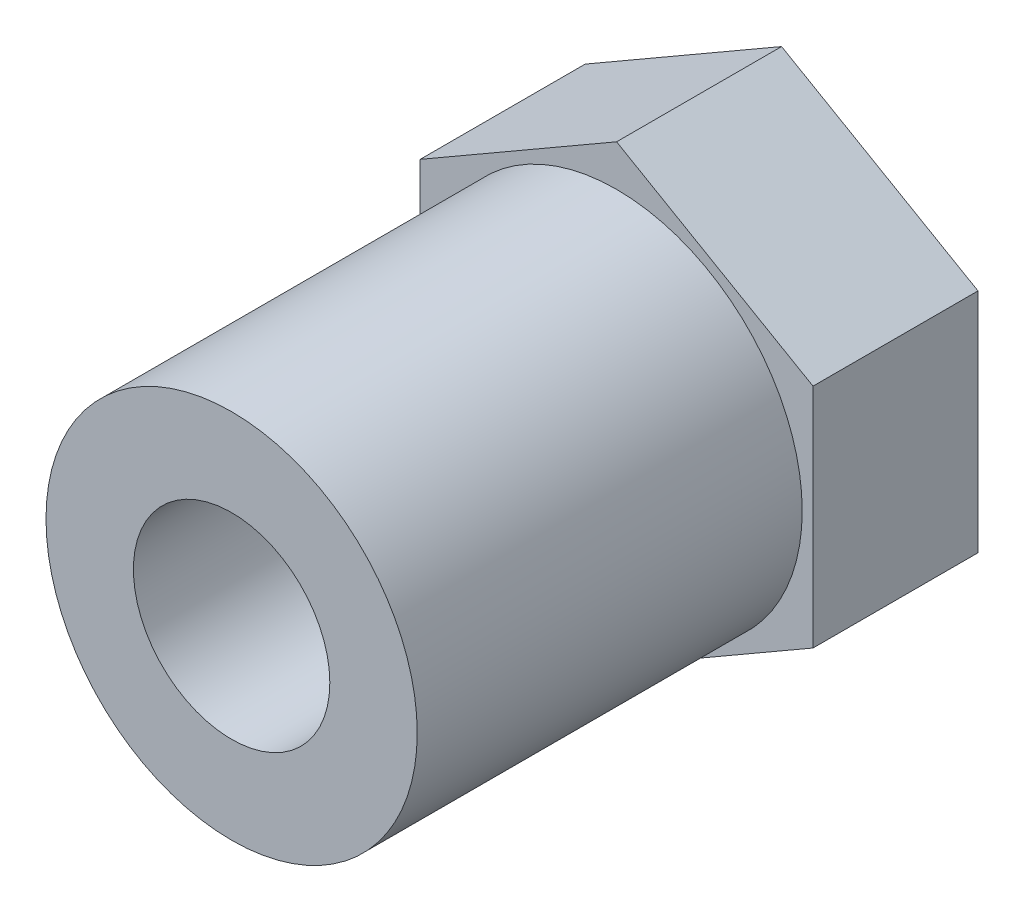
ISO-10303-21;
HEADER;
FILE_DESCRIPTION(('STEP AP214'),'2;1');
FILE_NAME('part.step','',(''),(''),'','','');
FILE_SCHEMA(('AUTOMOTIVE_DESIGN { 1 0 10303 214 1 1 1 1 }'));
ENDSEC;
DATA;
#1=APPLICATION_CONTEXT('core data for automotive mechanical design processes');
#2=APPLICATION_PROTOCOL_DEFINITION('international standard','automotive_design',2000,#1);
#3=PRODUCT_CONTEXT('',#1,'mechanical');
#4=PRODUCT('Part','Part','',(#3));
#5=PRODUCT_RELATED_PRODUCT_CATEGORY('part','',(#4));
#6=PRODUCT_DEFINITION_FORMATION('','',#4);
#7=PRODUCT_DEFINITION_CONTEXT('part definition',#1,'design');
#8=PRODUCT_DEFINITION('design','',#6,#7);
#9=PRODUCT_DEFINITION_SHAPE('','',#8);
#10=(LENGTH_UNIT() NAMED_UNIT(*) SI_UNIT(.MILLI.,.METRE.));
#11=(NAMED_UNIT(*) PLANE_ANGLE_UNIT() SI_UNIT($,.RADIAN.));
#12=(NAMED_UNIT(*) SI_UNIT($,.STERADIAN.) SOLID_ANGLE_UNIT());
#13=UNCERTAINTY_MEASURE_WITH_UNIT(LENGTH_MEASURE(1.E-05),#10,'distance_accuracy_value','');
#14=(GEOMETRIC_REPRESENTATION_CONTEXT(3) GLOBAL_UNCERTAINTY_ASSIGNED_CONTEXT((#13)) GLOBAL_UNIT_ASSIGNED_CONTEXT((#10,
#11,#12)) REPRESENTATION_CONTEXT('',''));
#15=CARTESIAN_POINT('',(0.,0.,0.));
#16=DIRECTION('',(0.,0.,1.));
#17=DIRECTION('',(1.,0.,0.));
#18=AXIS2_PLACEMENT_3D('',#15,#16,#17);
#19=CARTESIAN_POINT('',(0.,0.,4.2));
#20=DIRECTION('',(0.,0.,1.));
#21=DIRECTION('',(1.,0.,0.));
#22=AXIS2_PLACEMENT_3D('',#19,#20,#21);
#23=PLANE('',#22);
#24=CARTESIAN_POINT('',(0.,0.,4.2));
#25=DIRECTION('',(0.,0.,1.));
#26=DIRECTION('',(1.,0.,0.));
#27=AXIS2_PLACEMENT_3D('',#24,#25,#26);
#28=CIRCLE('',#27,4.725);
#29=CARTESIAN_POINT('',(4.725,0.,4.2));
#30=VERTEX_POINT('',#29);
#31=EDGE_CURVE('E11',#30,#30,#28,.T.);
#32=ORIENTED_EDGE('',*,*,#31,.F.);
#33=EDGE_LOOP('',(#32));
#34=FACE_BOUND('',#33,.T.);
#35=DIRECTION('',(0.,1.,0.));
#36=VECTOR('',#35,1.);
#37=CARTESIAN_POINT('',(5.,-2.88675134594813,4.2));
#38=LINE('',#37,#36);
#39=CARTESIAN_POINT('',(5.,-2.88675134594813,4.2));
#40=VERTEX_POINT('',#39);
#41=CARTESIAN_POINT('',(5.,2.88675134594813,4.2));
#42=VERTEX_POINT('',#41);
#43=EDGE_CURVE('E130',#40,#42,#38,.T.);
#44=ORIENTED_EDGE('',*,*,#43,.T.);
#45=DIRECTION('',(-0.866025403784439,0.5,0.));
#46=VECTOR('',#45,1.);
#47=CARTESIAN_POINT('',(5.,2.88675134594813,4.2));
#48=LINE('',#47,#46);
#49=CARTESIAN_POINT('',(0.,5.77350269189626,4.2));
#50=VERTEX_POINT('',#49);
#51=EDGE_CURVE('E89',#42,#50,#48,.T.);
#52=ORIENTED_EDGE('',*,*,#51,.T.);
#53=DIRECTION('',(-0.866025403784438,-0.500000000000001,0.));
#54=VECTOR('',#53,1.);
#55=CARTESIAN_POINT('',(0.,5.77350269189626,4.2));
#56=LINE('',#55,#54);
#57=CARTESIAN_POINT('',(-5.,2.88675134594813,4.2));
#58=VERTEX_POINT('',#57);
#59=EDGE_CURVE('E101',#50,#58,#56,.T.);
#60=ORIENTED_EDGE('',*,*,#59,.T.);
#61=DIRECTION('',(0.,-1.,0.));
#62=VECTOR('',#61,1.);
#63=CARTESIAN_POINT('',(-5.,2.88675134594813,4.2));
#64=LINE('',#63,#62);
#65=CARTESIAN_POINT('',(-5.,-2.88675134594813,4.2));
#66=VERTEX_POINT('',#65);
#67=EDGE_CURVE('E96',#58,#66,#64,.T.);
#68=ORIENTED_EDGE('',*,*,#67,.T.);
#69=DIRECTION('',(0.866025403784439,-0.5,0.));
#70=VECTOR('',#69,1.);
#71=CARTESIAN_POINT('',(-5.,-2.88675134594813,4.2));
#72=LINE('',#71,#70);
#73=CARTESIAN_POINT('',(0.,-5.77350269189626,4.2));
#74=VERTEX_POINT('',#73);
#75=EDGE_CURVE('E99',#66,#74,#72,.T.);
#76=ORIENTED_EDGE('',*,*,#75,.T.);
#77=DIRECTION('',(0.866025403784438,0.5,0.));
#78=VECTOR('',#77,1.);
#79=CARTESIAN_POINT('',(0.,-5.77350269189626,4.2));
#80=LINE('',#79,#78);
#81=EDGE_CURVE('E51',#74,#40,#80,.T.);
#82=ORIENTED_EDGE('',*,*,#81,.T.);
#83=EDGE_LOOP('',(#44,#52,#60,#68,#76,#82));
#84=FACE_BOUND('',#83,.T.);
#85=ADVANCED_FACE('F33',(#34,#84),#23,.T.);
#86=CARTESIAN_POINT('',(0.,0.,0.));
#87=DIRECTION('',(0.,0.,1.));
#88=DIRECTION('',(1.,0.,0.));
#89=AXIS2_PLACEMENT_3D('',#86,#87,#88);
#90=PLANE('',#89);
#91=DIRECTION('',(0.,1.,0.));
#92=VECTOR('',#91,1.);
#93=CARTESIAN_POINT('',(5.,-2.88675134594813,0.));
#94=LINE('',#93,#92);
#95=CARTESIAN_POINT('',(5.,-2.88675134594813,0.));
#96=VERTEX_POINT('',#95);
#97=CARTESIAN_POINT('',(5.,2.88675134594813,0.));
#98=VERTEX_POINT('',#97);
#99=EDGE_CURVE('E119',#96,#98,#94,.T.);
#100=ORIENTED_EDGE('',*,*,#99,.F.);
#101=DIRECTION('',(0.866025403784438,0.5,0.));
#102=VECTOR('',#101,1.);
#103=CARTESIAN_POINT('',(0.,-5.77350269189626,0.));
#104=LINE('',#103,#102);
#105=CARTESIAN_POINT('',(0.,-5.77350269189626,0.));
#106=VERTEX_POINT('',#105);
#107=EDGE_CURVE('E80',#106,#96,#104,.T.);
#108=ORIENTED_EDGE('',*,*,#107,.F.);
#109=DIRECTION('',(0.866025403784439,-0.5,0.));
#110=VECTOR('',#109,1.);
#111=CARTESIAN_POINT('',(-5.,-2.88675134594813,0.));
#112=LINE('',#111,#110);
#113=CARTESIAN_POINT('',(-5.,-2.88675134594813,0.));
#114=VERTEX_POINT('',#113);
#115=EDGE_CURVE('E74',#114,#106,#112,.T.);
#116=ORIENTED_EDGE('',*,*,#115,.F.);
#117=DIRECTION('',(0.,-1.,0.));
#118=VECTOR('',#117,1.);
#119=CARTESIAN_POINT('',(-5.,2.88675134594813,0.));
#120=LINE('',#119,#118);
#121=CARTESIAN_POINT('',(-5.,2.88675134594813,0.));
#122=VERTEX_POINT('',#121);
#123=EDGE_CURVE('E109',#122,#114,#120,.T.);
#124=ORIENTED_EDGE('',*,*,#123,.F.);
#125=DIRECTION('',(-0.866025403784438,-0.500000000000001,0.));
#126=VECTOR('',#125,1.);
#127=CARTESIAN_POINT('',(0.,5.77350269189626,0.));
#128=LINE('',#127,#126);
#129=CARTESIAN_POINT('',(0.,5.77350269189626,0.));
#130=VERTEX_POINT('',#129);
#131=EDGE_CURVE('E125',#130,#122,#128,.T.);
#132=ORIENTED_EDGE('',*,*,#131,.F.);
#133=DIRECTION('',(-0.866025403784439,0.5,0.));
#134=VECTOR('',#133,1.);
#135=CARTESIAN_POINT('',(5.,2.88675134594813,0.));
#136=LINE('',#135,#134);
#137=EDGE_CURVE('E122',#98,#130,#136,.T.);
#138=ORIENTED_EDGE('',*,*,#137,.F.);
#139=EDGE_LOOP('',(#100,#108,#116,#124,#132,#138));
#140=FACE_BOUND('',#139,.T.);
#141=CARTESIAN_POINT('',(0.,0.,0.));
#142=DIRECTION('',(0.,0.,1.));
#143=DIRECTION('',(1.,0.,0.));
#144=AXIS2_PLACEMENT_3D('',#141,#142,#143);
#145=CIRCLE('',#144,2.5);
#146=CARTESIAN_POINT('',(2.5,0.,0.));
#147=VERTEX_POINT('',#146);
#148=EDGE_CURVE('E123',#147,#147,#145,.T.);
#149=ORIENTED_EDGE('',*,*,#148,.T.);
#150=EDGE_LOOP('',(#149));
#151=FACE_BOUND('',#150,.T.);
#152=ADVANCED_FACE('F143',(#140,#151),#90,.F.);
#153=CARTESIAN_POINT('',(5.,-2.88675134594813,4.2));
#154=DIRECTION('',(-1.,0.,0.));
#155=DIRECTION('',(0.,-1.,0.));
#156=AXIS2_PLACEMENT_3D('',#153,#154,#155);
#157=PLANE('',#156);
#158=ORIENTED_EDGE('',*,*,#99,.T.);
#159=DIRECTION('',(0.,0.,-1.));
#160=VECTOR('',#159,1.);
#161=CARTESIAN_POINT('',(5.,2.88675134594813,4.2));
#162=LINE('',#161,#160);
#163=EDGE_CURVE('E37',#42,#98,#162,.T.);
#164=ORIENTED_EDGE('',*,*,#163,.F.);
#165=ORIENTED_EDGE('',*,*,#43,.F.);
#166=DIRECTION('',(0.,0.,-1.));
#167=VECTOR('',#166,1.);
#168=CARTESIAN_POINT('',(5.,-2.88675134594813,4.2));
#169=LINE('',#168,#167);
#170=EDGE_CURVE('E115',#40,#96,#169,.T.);
#171=ORIENTED_EDGE('',*,*,#170,.T.);
#172=EDGE_LOOP('',(#158,#164,#165,#171));
#173=FACE_BOUND('',#172,.T.);
#174=ADVANCED_FACE('F35',(#173),#157,.F.);
#175=CARTESIAN_POINT('',(5.,2.88675134594813,4.2));
#176=DIRECTION('',(-0.5,-0.866025403784439,0.));
#177=DIRECTION('',(0.866025403784439,-0.5,0.));
#178=AXIS2_PLACEMENT_3D('',#175,#176,#177);
#179=PLANE('',#178);
#180=ORIENTED_EDGE('',*,*,#137,.T.);
#181=DIRECTION('',(0.,0.,-1.));
#182=VECTOR('',#181,1.);
#183=CARTESIAN_POINT('',(0.,5.77350269189626,4.2));
#184=LINE('',#183,#182);
#185=EDGE_CURVE('E133',#50,#130,#184,.T.);
#186=ORIENTED_EDGE('',*,*,#185,.F.);
#187=ORIENTED_EDGE('',*,*,#51,.F.);
#188=ORIENTED_EDGE('',*,*,#163,.T.);
#189=EDGE_LOOP('',(#180,#186,#187,#188));
#190=FACE_BOUND('',#189,.T.);
#191=ADVANCED_FACE('F138',(#190),#179,.F.);
#192=CARTESIAN_POINT('',(0.,5.77350269189626,4.2));
#193=DIRECTION('',(0.500000000000001,-0.866025403784438,0.));
#194=DIRECTION('',(0.866025403784438,0.500000000000001,0.));
#195=AXIS2_PLACEMENT_3D('',#192,#193,#194);
#196=PLANE('',#195);
#197=ORIENTED_EDGE('',*,*,#131,.T.);
#198=DIRECTION('',(0.,0.,-1.));
#199=VECTOR('',#198,1.);
#200=CARTESIAN_POINT('',(-5.,2.88675134594813,4.2));
#201=LINE('',#200,#199);
#202=EDGE_CURVE('E110',#58,#122,#201,.T.);
#203=ORIENTED_EDGE('',*,*,#202,.F.);
#204=ORIENTED_EDGE('',*,*,#59,.F.);
#205=ORIENTED_EDGE('',*,*,#185,.T.);
#206=EDGE_LOOP('',(#197,#203,#204,#205));
#207=FACE_BOUND('',#206,.T.);
#208=ADVANCED_FACE('F145',(#207),#196,.F.);
#209=CARTESIAN_POINT('',(-5.,2.88675134594813,4.2));
#210=DIRECTION('',(1.,0.,0.));
#211=DIRECTION('',(0.,1.,0.));
#212=AXIS2_PLACEMENT_3D('',#209,#210,#211);
#213=PLANE('',#212);
#214=ORIENTED_EDGE('',*,*,#123,.T.);
#215=DIRECTION('',(0.,0.,-1.));
#216=VECTOR('',#215,1.);
#217=CARTESIAN_POINT('',(-5.,-2.88675134594813,4.2));
#218=LINE('',#217,#216);
#219=EDGE_CURVE('E106',#66,#114,#218,.T.);
#220=ORIENTED_EDGE('',*,*,#219,.F.);
#221=ORIENTED_EDGE('',*,*,#67,.F.);
#222=ORIENTED_EDGE('',*,*,#202,.T.);
#223=EDGE_LOOP('',(#214,#220,#221,#222));
#224=FACE_BOUND('',#223,.T.);
#225=ADVANCED_FACE('F107',(#224),#213,.F.);
#226=CARTESIAN_POINT('',(-5.,-2.88675134594813,4.2));
#227=DIRECTION('',(0.5,0.866025403784439,0.));
#228=DIRECTION('',(-0.866025403784439,0.5,0.));
#229=AXIS2_PLACEMENT_3D('',#226,#227,#228);
#230=PLANE('',#229);
#231=ORIENTED_EDGE('',*,*,#115,.T.);
#232=DIRECTION('',(0.,0.,-1.));
#233=VECTOR('',#232,1.);
#234=CARTESIAN_POINT('',(0.,-5.77350269189626,4.2));
#235=LINE('',#234,#233);
#236=EDGE_CURVE('E111',#74,#106,#235,.T.);
#237=ORIENTED_EDGE('',*,*,#236,.F.);
#238=ORIENTED_EDGE('',*,*,#75,.F.);
#239=ORIENTED_EDGE('',*,*,#219,.T.);
#240=EDGE_LOOP('',(#231,#237,#238,#239));
#241=FACE_BOUND('',#240,.T.);
#242=ADVANCED_FACE('F113',(#241),#230,.F.);
#243=CARTESIAN_POINT('',(0.,-5.77350269189626,4.2));
#244=DIRECTION('',(-0.5,0.866025403784438,0.));
#245=DIRECTION('',(-0.866025403784438,-0.5,0.));
#246=AXIS2_PLACEMENT_3D('',#243,#244,#245);
#247=PLANE('',#246);
#248=ORIENTED_EDGE('',*,*,#107,.T.);
#249=ORIENTED_EDGE('',*,*,#170,.F.);
#250=ORIENTED_EDGE('',*,*,#81,.F.);
#251=ORIENTED_EDGE('',*,*,#236,.T.);
#252=EDGE_LOOP('',(#248,#249,#250,#251));
#253=FACE_BOUND('',#252,.T.);
#254=ADVANCED_FACE('F171',(#253),#247,.F.);
#255=CARTESIAN_POINT('',(0.,0.,4.2));
#256=DIRECTION('',(0.,0.,-1.));
#257=DIRECTION('',(-1.,0.,0.));
#258=AXIS2_PLACEMENT_3D('',#255,#256,#257);
#259=CYLINDRICAL_SURFACE('',#258,2.5);
#260=ORIENTED_EDGE('',*,*,#148,.F.);
#261=EDGE_LOOP('',(#260));
#262=FACE_BOUND('',#261,.T.);
#263=CARTESIAN_POINT('',(0.,0.,14.));
#264=DIRECTION('',(0.,0.,1.));
#265=DIRECTION('',(1.,0.,0.));
#266=AXIS2_PLACEMENT_3D('',#263,#264,#265);
#267=CIRCLE('',#266,2.5);
#268=CARTESIAN_POINT('',(2.5,0.,14.));
#269=VERTEX_POINT('',#268);
#270=EDGE_CURVE('E154',#269,#269,#267,.T.);
#271=ORIENTED_EDGE('',*,*,#270,.T.);
#272=EDGE_LOOP('',(#271));
#273=FACE_BOUND('',#272,.T.);
#274=ADVANCED_FACE('F158',(#262,#273),#259,.F.);
#275=CARTESIAN_POINT('',(0.,0.,14.));
#276=DIRECTION('',(0.,0.,1.));
#277=DIRECTION('',(1.,0.,0.));
#278=AXIS2_PLACEMENT_3D('',#275,#276,#277);
#279=PLANE('',#278);
#280=CARTESIAN_POINT('',(0.,0.,14.));
#281=DIRECTION('',(0.,0.,1.));
#282=DIRECTION('',(1.,0.,0.));
#283=AXIS2_PLACEMENT_3D('',#280,#281,#282);
#284=CIRCLE('',#283,4.725);
#285=CARTESIAN_POINT('',(4.725,0.,14.));
#286=VERTEX_POINT('',#285);
#287=EDGE_CURVE('E150',#286,#286,#284,.T.);
#288=ORIENTED_EDGE('',*,*,#287,.T.);
#289=EDGE_LOOP('',(#288));
#290=FACE_BOUND('',#289,.T.);
#291=ORIENTED_EDGE('',*,*,#270,.F.);
#292=EDGE_LOOP('',(#291));
#293=FACE_BOUND('',#292,.T.);
#294=ADVANCED_FACE('F160',(#290,#293),#279,.T.);
#295=CARTESIAN_POINT('',(0.,0.,14.));
#296=DIRECTION('',(0.,0.,-1.));
#297=DIRECTION('',(-1.,0.,0.));
#298=AXIS2_PLACEMENT_3D('',#295,#296,#297);
#299=CYLINDRICAL_SURFACE('',#298,4.725);
#300=ORIENTED_EDGE('',*,*,#287,.F.);
#301=EDGE_LOOP('',(#300));
#302=FACE_BOUND('',#301,.T.);
#303=ORIENTED_EDGE('',*,*,#31,.T.);
#304=EDGE_LOOP('',(#303));
#305=FACE_BOUND('',#304,.T.);
#306=ADVANCED_FACE('F162',(#302,#305),#299,.T.);
#307=CLOSED_SHELL('',(#85,#152,#174,#191,#208,#225,#242,#254,#274,#294,#306));
#308=MANIFOLD_SOLID_BREP('B2',#307);
#309=ADVANCED_BREP_SHAPE_REPRESENTATION('',(#18,#308),#14);
#310=SHAPE_DEFINITION_REPRESENTATION(#9,#309);
ENDSEC;
END-ISO-10303-21;
